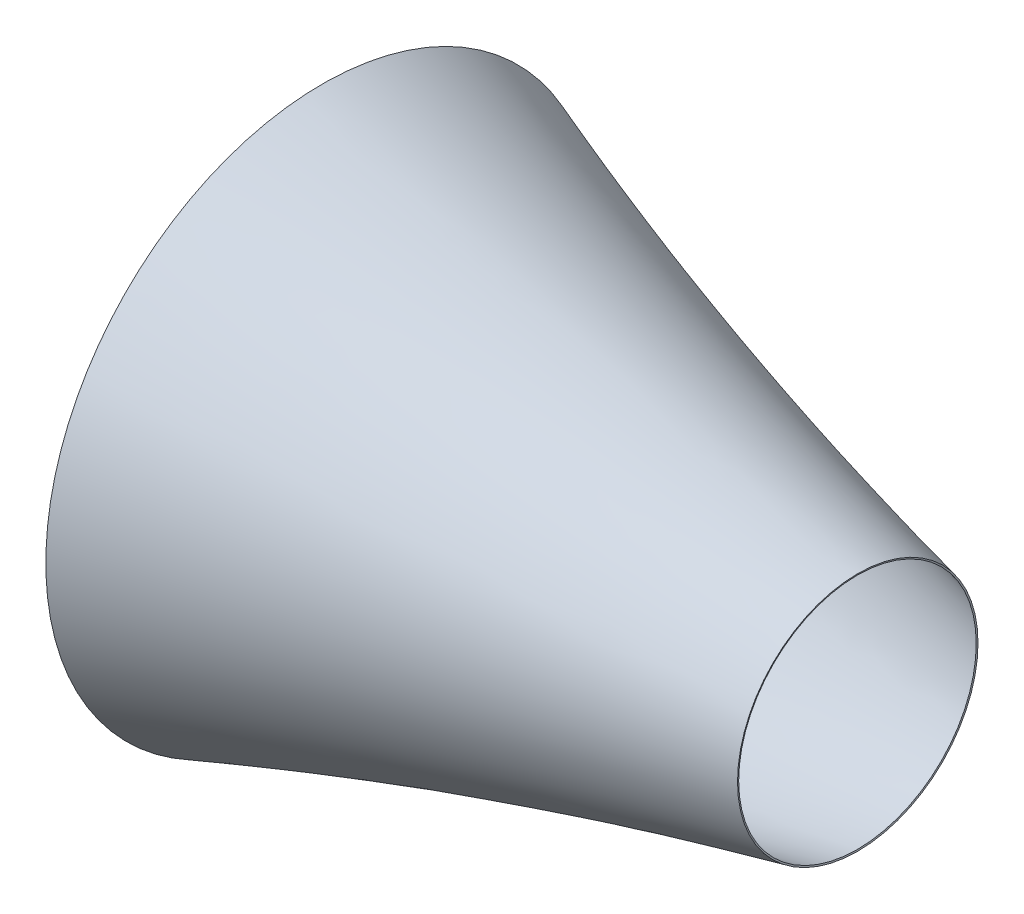
ISO-10303-21;
HEADER;
FILE_DESCRIPTION(('STEP AP214'),'2;1');
FILE_NAME('part.step','',(''),(''),'','','');
FILE_SCHEMA(('AUTOMOTIVE_DESIGN { 1 0 10303 214 1 1 1 1 }'));
ENDSEC;
DATA;
#1=APPLICATION_CONTEXT('core data for automotive mechanical design processes');
#2=APPLICATION_PROTOCOL_DEFINITION('international standard','automotive_design',2000,#1);
#3=PRODUCT_CONTEXT('',#1,'mechanical');
#4=PRODUCT('Part','Part','',(#3));
#5=PRODUCT_RELATED_PRODUCT_CATEGORY('part','',(#4));
#6=PRODUCT_DEFINITION_FORMATION('','',#4);
#7=PRODUCT_DEFINITION_CONTEXT('part definition',#1,'design');
#8=PRODUCT_DEFINITION('design','',#6,#7);
#9=PRODUCT_DEFINITION_SHAPE('','',#8);
#10=(LENGTH_UNIT() NAMED_UNIT(*) SI_UNIT(.MILLI.,.METRE.));
#11=(NAMED_UNIT(*) PLANE_ANGLE_UNIT() SI_UNIT($,.RADIAN.));
#12=(NAMED_UNIT(*) SI_UNIT($,.STERADIAN.) SOLID_ANGLE_UNIT());
#13=UNCERTAINTY_MEASURE_WITH_UNIT(LENGTH_MEASURE(1.E-05),#10,'distance_accuracy_value','');
#14=(GEOMETRIC_REPRESENTATION_CONTEXT(3) GLOBAL_UNCERTAINTY_ASSIGNED_CONTEXT((#13)) GLOBAL_UNIT_ASSIGNED_CONTEXT((#10,
#11,#12)) REPRESENTATION_CONTEXT('',''));
#15=CARTESIAN_POINT('',(0.,0.,0.));
#16=DIRECTION('',(0.,0.,1.));
#17=DIRECTION('',(1.,0.,0.));
#18=AXIS2_PLACEMENT_3D('',#15,#16,#17);
#19=CARTESIAN_POINT('',(58.1645223558109,0.,0.));
#20=DIRECTION('',(-1.,0.,0.));
#21=DIRECTION('',(0.,0.,1.));
#22=AXIS2_PLACEMENT_3D('',#19,#20,#21);
#23=PLANE('',#22);
#24=CARTESIAN_POINT('',(58.1645223558109,0.,0.));
#25=DIRECTION('',(1.,0.,0.));
#26=DIRECTION('',(0.,0.,-1.));
#27=AXIS2_PLACEMENT_3D('',#24,#25,#26);
#28=CIRCLE('',#27,825.);
#29=CARTESIAN_POINT('',(58.1645223558109,0.,-825.));
#30=VERTEX_POINT('',#29);
#31=EDGE_CURVE('E51',#30,#30,#28,.T.);
#32=ORIENTED_EDGE('',*,*,#31,.F.);
#33=EDGE_LOOP('',(#32));
#34=FACE_BOUND('',#33,.T.);
#35=CARTESIAN_POINT('',(58.1645223558109,0.,0.));
#36=DIRECTION('',(1.,0.,0.));
#37=DIRECTION('',(0.,0.,-1.));
#38=AXIS2_PLACEMENT_3D('',#35,#36,#37);
#39=CIRCLE('',#38,830.);
#40=CARTESIAN_POINT('',(58.1645223558109,0.,-830.));
#41=VERTEX_POINT('',#40);
#42=EDGE_CURVE('E114',#41,#41,#39,.T.);
#43=ORIENTED_EDGE('',*,*,#42,.T.);
#44=EDGE_LOOP('',(#43));
#45=FACE_BOUND('',#44,.T.);
#46=ADVANCED_FACE('F33',(#34,#45),#23,.F.);
#47=CARTESIAN_POINT('',(1800.,0.,0.));
#48=DIRECTION('',(1.,0.,0.));
#49=DIRECTION('',(0.,0.,-1.));
#50=AXIS2_PLACEMENT_3D('',#47,#48,#49);
#51=CONICAL_SURFACE('',#50,400.,1.35484019142392);
#52=CARTESIAN_POINT('',(1801.07140726163,0.,0.));
#53=DIRECTION('',(1.,0.,0.));
#54=DIRECTION('',(0.,1.,0.));
#55=AXIS2_PLACEMENT_3D('',#52,#53,#54);
#56=CIRCLE('',#55,404.88385979321);
#57=CARTESIAN_POINT('',(1801.07140726163,404.88385979321,0.));
#58=VERTEX_POINT('',#57);
#59=EDGE_CURVE('E10',#58,#58,#56,.T.);
#60=ORIENTED_EDGE('',*,*,#59,.T.);
#61=EDGE_LOOP('',(#60));
#62=FACE_BOUND('',#61,.T.);
#63=CARTESIAN_POINT('',(1800.,0.,0.));
#64=DIRECTION('',(1.,0.,0.));
#65=DIRECTION('',(0.,0.,-1.));
#66=AXIS2_PLACEMENT_3D('',#63,#64,#65);
#67=CIRCLE('',#66,400.);
#68=CARTESIAN_POINT('',(1800.,0.,-400.));
#69=VERTEX_POINT('',#68);
#70=EDGE_CURVE('E36',#69,#69,#67,.T.);
#71=ORIENTED_EDGE('',*,*,#70,.F.);
#72=EDGE_LOOP('',(#71));
#73=FACE_BOUND('',#72,.T.);
#74=ADVANCED_FACE('F150',(#62,#73),#51,.F.);
#75=CARTESIAN_POINT('',(1800.,400.,0.));
#76=CARTESIAN_POINT('',(882.6090630115,601.254612797229,0.));
#77=CARTESIAN_POINT('',(-8.826090630115,928.061767409367,0.));
#78=CARTESIAN_POINT('',(-17.65218126023,931.297481811467,0.));
#79=B_SPLINE_CURVE_WITH_KNOTS('',2,(#75,#76,#77,#78),.UNSPECIFIED.,.F.,.F.,(3,1,3),(0.,1.,1.01),.UNSPECIFIED.);
#80=CARTESIAN_POINT('',(0.,0.,0.));
#81=DIRECTION('',(1.,0.,0.));
#82=AXIS1_PLACEMENT('',#80,#81);
#83=SURFACE_OF_REVOLUTION('',#79,#82);
#84=OFFSET_SURFACE('',#83,-5.,.F.);
#85=CARTESIAN_POINT('',(-2.11682286139746,0.,0.));
#86=DIRECTION('',(1.,0.,0.));
#87=DIRECTION('',(0.,0.,-1.));
#88=AXIS2_PLACEMENT_3D('',#85,#86,#87);
#89=CIRCLE('',#88,930.927510882903);
#90=CARTESIAN_POINT('',(-2.11682286139746,0.,-930.927510882903));
#91=VERTEX_POINT('',#90);
#92=EDGE_CURVE('E40',#91,#91,#89,.T.);
#93=ORIENTED_EDGE('',*,*,#92,.T.);
#94=EDGE_LOOP('',(#93));
#95=FACE_BOUND('',#94,.T.);
#96=ORIENTED_EDGE('',*,*,#59,.F.);
#97=EDGE_LOOP('',(#96));
#98=FACE_BOUND('',#97,.T.);
#99=ADVANCED_FACE('F70',(#95,#98),#84,.F.);
#100=CARTESIAN_POINT('',(2.14183294659226,928.307615711513,0.));
#101=CARTESIAN_POINT('',(1.07091647329613,926.56683435939,0.));
#102=CARTESIAN_POINT('',(-40.6448771597789,858.757553751386,0.));
#103=CARTESIAN_POINT('',(0.745532448811899,798.922234092078,0.));
#104=CARTESIAN_POINT('',(1.4910648976238,797.844468184157,0.));
#105=B_SPLINE_CURVE_WITH_KNOTS('',2,(#100,#101,#102,#103,#104),.UNSPECIFIED.,.F.,.F.,(3,1,1,3),
(-0.02634812916487,0.,1.,1.01834259323459),.UNSPECIFIED.);
#106=CARTESIAN_POINT('',(0.,0.,0.));
#107=DIRECTION('',(1.,0.,0.));
#108=AXIS1_PLACEMENT('',#106,#107);
#109=SURFACE_OF_REVOLUTION('',#105,#108);
#110=OFFSET_SURFACE('',#109,-5.,.F.);
#111=CARTESIAN_POINT('',(-2.62099064058559,0.,0.));
#112=DIRECTION('',(1.,0.,0.));
#113=DIRECTION('',(0.,0.,-1.));
#114=AXIS2_PLACEMENT_3D('',#111,#112,#113);
#115=CIRCLE('',#114,795.);
#116=CARTESIAN_POINT('',(-2.62099064058559,0.,-795.));
#117=VERTEX_POINT('',#116);
#118=EDGE_CURVE('E45',#117,#117,#115,.T.);
#119=ORIENTED_EDGE('',*,*,#118,.T.);
#120=EDGE_LOOP('',(#119));
#121=FACE_BOUND('',#120,.T.);
#122=ORIENTED_EDGE('',*,*,#92,.F.);
#123=EDGE_LOOP('',(#122));
#124=FACE_BOUND('',#123,.T.);
#125=ADVANCED_FACE('F71',(#121,#124),#110,.F.);
#126=CARTESIAN_POINT('',(0.,0.,0.));
#127=DIRECTION('',(1.,0.,0.));
#128=DIRECTION('',(0.,0.,-1.));
#129=AXIS2_PLACEMENT_3D('',#126,#127,#128);
#130=CYLINDRICAL_SURFACE('',#129,795.);
#131=CARTESIAN_POINT('',(28.8211041168073,0.,0.));
#132=DIRECTION('',(1.,0.,0.));
#133=DIRECTION('',(0.,0.,-1.));
#134=AXIS2_PLACEMENT_3D('',#131,#132,#133);
#135=CIRCLE('',#134,795.);
#136=CARTESIAN_POINT('',(28.8211041168073,0.,-795.));
#137=VERTEX_POINT('',#136);
#138=EDGE_CURVE('E54',#137,#137,#135,.T.);
#139=ORIENTED_EDGE('',*,*,#138,.T.);
#140=EDGE_LOOP('',(#139));
#141=FACE_BOUND('',#140,.T.);
#142=ORIENTED_EDGE('',*,*,#118,.F.);
#143=EDGE_LOOP('',(#142));
#144=FACE_BOUND('',#143,.T.);
#145=ADVANCED_FACE('F74',(#141,#144),#130,.F.);
#146=CARTESIAN_POINT('',(29.8245244772304,0.,0.));
#147=DIRECTION('',(1.,0.,0.));
#148=DIRECTION('',(0.,0.,-1.));
#149=AXIS2_PLACEMENT_3D('',#146,#147,#148);
#150=CONICAL_SURFACE('',#149,798.687002068317,1.30508097022597);
#151=CARTESIAN_POINT('',(36.9856264726182,0.,0.));
#152=DIRECTION('',(1.,0.,0.));
#153=DIRECTION('',(0.,0.,-1.));
#154=AXIS2_PLACEMENT_3D('',#151,#152,#153);
#155=CIRCLE('',#154,825.);
#156=CARTESIAN_POINT('',(36.9856264726182,0.,-825.));
#157=VERTEX_POINT('',#156);
#158=EDGE_CURVE('E49',#157,#157,#155,.T.);
#159=ORIENTED_EDGE('',*,*,#158,.T.);
#160=EDGE_LOOP('',(#159));
#161=FACE_BOUND('',#160,.T.);
#162=ORIENTED_EDGE('',*,*,#138,.F.);
#163=EDGE_LOOP('',(#162));
#164=FACE_BOUND('',#163,.T.);
#165=ADVANCED_FACE('F80',(#161,#164),#150,.F.);
#166=CARTESIAN_POINT('',(0.,0.,0.));
#167=DIRECTION('',(1.,0.,0.));
#168=DIRECTION('',(0.,0.,-1.));
#169=AXIS2_PLACEMENT_3D('',#166,#167,#168);
#170=CYLINDRICAL_SURFACE('',#169,825.);
#171=ORIENTED_EDGE('',*,*,#31,.T.);
#172=EDGE_LOOP('',(#171));
#173=FACE_BOUND('',#172,.T.);
#174=ORIENTED_EDGE('',*,*,#158,.F.);
#175=EDGE_LOOP('',(#174));
#176=FACE_BOUND('',#175,.T.);
#177=ADVANCED_FACE('F84',(#173,#176),#170,.F.);
#178=CARTESIAN_POINT('',(1800.,400.,0.));
#179=CARTESIAN_POINT('',(882.6090630115,601.254612797229,0.));
#180=CARTESIAN_POINT('',(0.,924.826053007267,0.));
#181=B_SPLINE_CURVE_WITH_KNOTS('',2,(#178,#179,#180),.UNSPECIFIED.,.F.,.F.,(3,3),(0.,1.),.UNSPECIFIED.);
#182=CARTESIAN_POINT('',(0.,0.,0.));
#183=DIRECTION('',(1.,0.,0.));
#184=AXIS1_PLACEMENT('',#182,#183);
#185=SURFACE_OF_REVOLUTION('',#181,#184);
#186=CARTESIAN_POINT('',(0.,0.,0.));
#187=DIRECTION('',(1.,0.,0.));
#188=DIRECTION('',(0.,0.,-1.));
#189=AXIS2_PLACEMENT_3D('',#186,#187,#188);
#190=CIRCLE('',#189,924.826053007267);
#191=CARTESIAN_POINT('',(0.,0.,-924.826053007267));
#192=VERTEX_POINT('',#191);
#193=EDGE_CURVE('E128',#192,#192,#190,.T.);
#194=ORIENTED_EDGE('',*,*,#193,.F.);
#195=EDGE_LOOP('',(#194));
#196=FACE_BOUND('',#195,.T.);
#197=ORIENTED_EDGE('',*,*,#70,.T.);
#198=EDGE_LOOP('',(#197));
#199=FACE_BOUND('',#198,.T.);
#200=ADVANCED_FACE('F88',(#196,#199),#185,.T.);
#201=CARTESIAN_POINT('',(0.,924.826053007267,0.));
#202=CARTESIAN_POINT('',(-40.6448771597789,858.757553751386,0.));
#203=CARTESIAN_POINT('',(0.,800.,0.));
#204=B_SPLINE_CURVE_WITH_KNOTS('',2,(#201,#202,#203),.UNSPECIFIED.,.F.,.F.,(3,3),(0.,1.),.UNSPECIFIED.);
#205=CARTESIAN_POINT('',(0.,0.,0.));
#206=DIRECTION('',(1.,0.,0.));
#207=AXIS1_PLACEMENT('',#205,#206);
#208=SURFACE_OF_REVOLUTION('',#204,#207);
#209=CARTESIAN_POINT('',(0.,0.,0.));
#210=DIRECTION('',(1.,0.,0.));
#211=DIRECTION('',(0.,0.,-1.));
#212=AXIS2_PLACEMENT_3D('',#209,#210,#211);
#213=CIRCLE('',#212,800.);
#214=CARTESIAN_POINT('',(0.,0.,-800.));
#215=VERTEX_POINT('',#214);
#216=EDGE_CURVE('E126',#215,#215,#213,.T.);
#217=ORIENTED_EDGE('',*,*,#216,.F.);
#218=EDGE_LOOP('',(#217));
#219=FACE_BOUND('',#218,.T.);
#220=ORIENTED_EDGE('',*,*,#193,.T.);
#221=EDGE_LOOP('',(#220));
#222=FACE_BOUND('',#221,.T.);
#223=ADVANCED_FACE('F101',(#219,#222),#208,.T.);
#224=CARTESIAN_POINT('',(0.,0.,0.));
#225=DIRECTION('',(1.,0.,0.));
#226=DIRECTION('',(0.,0.,-1.));
#227=AXIS2_PLACEMENT_3D('',#224,#225,#226);
#228=CYLINDRICAL_SURFACE('',#227,800.);
#229=CARTESIAN_POINT('',(25.,0.,0.));
#230=DIRECTION('',(1.,0.,0.));
#231=DIRECTION('',(0.,0.,-1.));
#232=AXIS2_PLACEMENT_3D('',#229,#230,#231);
#233=CIRCLE('',#232,800.);
#234=CARTESIAN_POINT('',(25.,0.,-800.));
#235=VERTEX_POINT('',#234);
#236=EDGE_CURVE('E120',#235,#235,#233,.T.);
#237=ORIENTED_EDGE('',*,*,#236,.F.);
#238=EDGE_LOOP('',(#237));
#239=FACE_BOUND('',#238,.T.);
#240=ORIENTED_EDGE('',*,*,#216,.T.);
#241=EDGE_LOOP('',(#240));
#242=FACE_BOUND('',#241,.T.);
#243=ADVANCED_FACE('F97',(#239,#242),#228,.T.);
#244=CARTESIAN_POINT('',(25.,0.,0.));
#245=DIRECTION('',(1.,0.,0.));
#246=DIRECTION('',(0.,0.,-1.));
#247=AXIS2_PLACEMENT_3D('',#244,#245,#246);
#248=CONICAL_SURFACE('',#247,800.,1.30508097022597);
#249=CARTESIAN_POINT('',(33.1645223558109,0.,0.));
#250=DIRECTION('',(1.,0.,0.));
#251=DIRECTION('',(0.,0.,-1.));
#252=AXIS2_PLACEMENT_3D('',#249,#250,#251);
#253=CIRCLE('',#252,830.);
#254=CARTESIAN_POINT('',(33.1645223558109,0.,-830.));
#255=VERTEX_POINT('',#254);
#256=EDGE_CURVE('E121',#255,#255,#253,.T.);
#257=ORIENTED_EDGE('',*,*,#256,.F.);
#258=EDGE_LOOP('',(#257));
#259=FACE_BOUND('',#258,.T.);
#260=ORIENTED_EDGE('',*,*,#236,.T.);
#261=EDGE_LOOP('',(#260));
#262=FACE_BOUND('',#261,.T.);
#263=ADVANCED_FACE('F93',(#259,#262),#248,.T.);
#264=CARTESIAN_POINT('',(0.,0.,0.));
#265=DIRECTION('',(1.,0.,0.));
#266=DIRECTION('',(0.,0.,-1.));
#267=AXIS2_PLACEMENT_3D('',#264,#265,#266);
#268=CYLINDRICAL_SURFACE('',#267,830.);
#269=ORIENTED_EDGE('',*,*,#42,.F.);
#270=EDGE_LOOP('',(#269));
#271=FACE_BOUND('',#270,.T.);
#272=ORIENTED_EDGE('',*,*,#256,.T.);
#273=EDGE_LOOP('',(#272));
#274=FACE_BOUND('',#273,.T.);
#275=ADVANCED_FACE('F90',(#271,#274),#268,.T.);
#276=CLOSED_SHELL('',(#46,#74,#99,#125,#145,#165,#177,#200,#223,#243,#263,#275));
#277=MANIFOLD_SOLID_BREP('B2',#276);
#278=ADVANCED_BREP_SHAPE_REPRESENTATION('',(#18,#277),#14);
#279=SHAPE_DEFINITION_REPRESENTATION(#9,#278);
ENDSEC;
END-ISO-10303-21;
